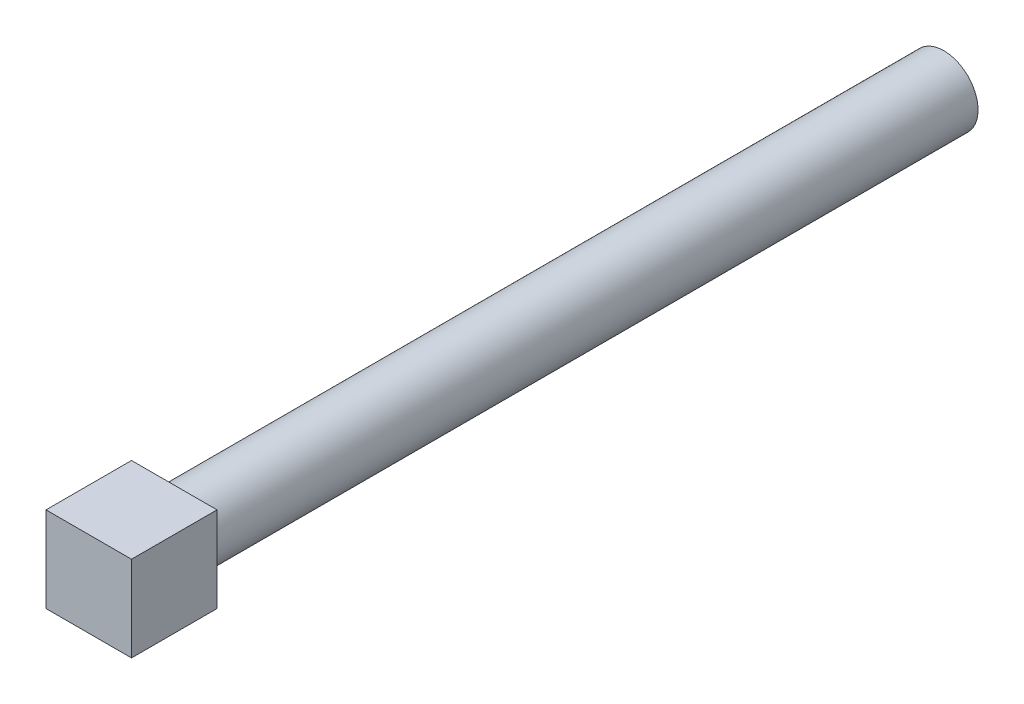
ISO-10303-21;
HEADER;
FILE_DESCRIPTION(('STEP AP214'),'2;1');
FILE_NAME('part.step','',(''),(''),'','','');
FILE_SCHEMA(('AUTOMOTIVE_DESIGN { 1 0 10303 214 1 1 1 1 }'));
ENDSEC;
DATA;
#1=APPLICATION_CONTEXT('core data for automotive mechanical design processes');
#2=APPLICATION_PROTOCOL_DEFINITION('international standard','automotive_design',2000,#1);
#3=PRODUCT_CONTEXT('',#1,'mechanical');
#4=PRODUCT('Part','Part','',(#3));
#5=PRODUCT_RELATED_PRODUCT_CATEGORY('part','',(#4));
#6=PRODUCT_DEFINITION_FORMATION('','',#4);
#7=PRODUCT_DEFINITION_CONTEXT('part definition',#1,'design');
#8=PRODUCT_DEFINITION('design','',#6,#7);
#9=PRODUCT_DEFINITION_SHAPE('','',#8);
#10=(LENGTH_UNIT() NAMED_UNIT(*) SI_UNIT(.MILLI.,.METRE.));
#11=(NAMED_UNIT(*) PLANE_ANGLE_UNIT() SI_UNIT($,.RADIAN.));
#12=(NAMED_UNIT(*) SI_UNIT($,.STERADIAN.) SOLID_ANGLE_UNIT());
#13=UNCERTAINTY_MEASURE_WITH_UNIT(LENGTH_MEASURE(1.E-05),#10,'distance_accuracy_value','');
#14=(GEOMETRIC_REPRESENTATION_CONTEXT(3) GLOBAL_UNCERTAINTY_ASSIGNED_CONTEXT((#13)) GLOBAL_UNIT_ASSIGNED_CONTEXT((#10,
#11,#12)) REPRESENTATION_CONTEXT('',''));
#15=CARTESIAN_POINT('',(0.,0.,0.));
#16=DIRECTION('',(0.,0.,1.));
#17=DIRECTION('',(1.,0.,0.));
#18=AXIS2_PLACEMENT_3D('',#15,#16,#17);
#19=CARTESIAN_POINT('',(-5.,5.,10.));
#20=DIRECTION('',(1.,0.,0.));
#21=DIRECTION('',(0.,1.,0.));
#22=AXIS2_PLACEMENT_3D('',#19,#20,#21);
#23=PLANE('',#22);
#24=DIRECTION('',(0.,-1.,0.));
#25=VECTOR('',#24,1.);
#26=CARTESIAN_POINT('',(-5.,5.,0.));
#27=LINE('',#26,#25);
#28=CARTESIAN_POINT('',(-5.,5.,0.));
#29=VERTEX_POINT('',#28);
#30=CARTESIAN_POINT('',(-5.,-5.,0.));
#31=VERTEX_POINT('',#30);
#32=EDGE_CURVE('E100',#29,#31,#27,.T.);
#33=ORIENTED_EDGE('',*,*,#32,.T.);
#34=DIRECTION('',(0.,0.,-1.));
#35=VECTOR('',#34,1.);
#36=CARTESIAN_POINT('',(-5.,-5.,10.));
#37=LINE('',#36,#35);
#38=CARTESIAN_POINT('',(-5.,-5.,10.));
#39=VERTEX_POINT('',#38);
#40=EDGE_CURVE('E37',#39,#31,#37,.T.);
#41=ORIENTED_EDGE('',*,*,#40,.F.);
#42=DIRECTION('',(0.,-1.,0.));
#43=VECTOR('',#42,1.);
#44=CARTESIAN_POINT('',(-5.,5.,10.));
#45=LINE('',#44,#43);
#46=CARTESIAN_POINT('',(-5.,5.,10.));
#47=VERTEX_POINT('',#46);
#48=EDGE_CURVE('E87',#47,#39,#45,.T.);
#49=ORIENTED_EDGE('',*,*,#48,.F.);
#50=DIRECTION('',(0.,0.,-1.));
#51=VECTOR('',#50,1.);
#52=CARTESIAN_POINT('',(-5.,5.,10.));
#53=LINE('',#52,#51);
#54=EDGE_CURVE('E96',#47,#29,#53,.T.);
#55=ORIENTED_EDGE('',*,*,#54,.T.);
#56=EDGE_LOOP('',(#33,#41,#49,#55));
#57=FACE_BOUND('',#56,.T.);
#58=ADVANCED_FACE('F34',(#57),#23,.F.);
#59=CARTESIAN_POINT('',(-5.,-5.,10.));
#60=DIRECTION('',(0.,1.,0.));
#61=DIRECTION('',(0.,0.,1.));
#62=AXIS2_PLACEMENT_3D('',#59,#60,#61);
#63=PLANE('',#62);
#64=DIRECTION('',(1.,0.,0.));
#65=VECTOR('',#64,1.);
#66=CARTESIAN_POINT('',(-5.,-5.,0.));
#67=LINE('',#66,#65);
#68=CARTESIAN_POINT('',(5.,-5.,0.));
#69=VERTEX_POINT('',#68);
#70=EDGE_CURVE('E92',#31,#69,#67,.T.);
#71=ORIENTED_EDGE('',*,*,#70,.T.);
#72=DIRECTION('',(0.,0.,-1.));
#73=VECTOR('',#72,1.);
#74=CARTESIAN_POINT('',(5.,-5.,10.));
#75=LINE('',#74,#73);
#76=CARTESIAN_POINT('',(5.,-5.,10.));
#77=VERTEX_POINT('',#76);
#78=EDGE_CURVE('E90',#77,#69,#75,.T.);
#79=ORIENTED_EDGE('',*,*,#78,.F.);
#80=DIRECTION('',(1.,0.,0.));
#81=VECTOR('',#80,1.);
#82=CARTESIAN_POINT('',(-5.,-5.,10.));
#83=LINE('',#82,#81);
#84=EDGE_CURVE('E82',#39,#77,#83,.T.);
#85=ORIENTED_EDGE('',*,*,#84,.F.);
#86=ORIENTED_EDGE('',*,*,#40,.T.);
#87=EDGE_LOOP('',(#71,#79,#85,#86));
#88=FACE_BOUND('',#87,.T.);
#89=ADVANCED_FACE('F91',(#88),#63,.F.);
#90=CARTESIAN_POINT('',(5.,5.,10.));
#91=DIRECTION('',(-1.,0.,0.));
#92=DIRECTION('',(0.,-1.,0.));
#93=AXIS2_PLACEMENT_3D('',#90,#91,#92);
#94=PLANE('',#93);
#95=DIRECTION('',(0.,1.,0.));
#96=VECTOR('',#95,1.);
#97=CARTESIAN_POINT('',(5.,5.,0.));
#98=LINE('',#97,#96);
#99=CARTESIAN_POINT('',(5.,5.,0.));
#100=VERTEX_POINT('',#99);
#101=EDGE_CURVE('E68',#69,#100,#98,.T.);
#102=ORIENTED_EDGE('',*,*,#101,.T.);
#103=DIRECTION('',(0.,0.,-1.));
#104=VECTOR('',#103,1.);
#105=CARTESIAN_POINT('',(5.,5.,10.));
#106=LINE('',#105,#104);
#107=CARTESIAN_POINT('',(5.,5.,10.));
#108=VERTEX_POINT('',#107);
#109=EDGE_CURVE('E93',#108,#100,#106,.T.);
#110=ORIENTED_EDGE('',*,*,#109,.F.);
#111=DIRECTION('',(0.,1.,0.));
#112=VECTOR('',#111,1.);
#113=CARTESIAN_POINT('',(5.,5.,10.));
#114=LINE('',#113,#112);
#115=EDGE_CURVE('E85',#77,#108,#114,.T.);
#116=ORIENTED_EDGE('',*,*,#115,.F.);
#117=ORIENTED_EDGE('',*,*,#78,.T.);
#118=EDGE_LOOP('',(#102,#110,#116,#117));
#119=FACE_BOUND('',#118,.T.);
#120=ADVANCED_FACE('F94',(#119),#94,.F.);
#121=CARTESIAN_POINT('',(-5.,5.,10.));
#122=DIRECTION('',(0.,-1.,0.));
#123=DIRECTION('',(0.,0.,-1.));
#124=AXIS2_PLACEMENT_3D('',#121,#122,#123);
#125=PLANE('',#124);
#126=DIRECTION('',(-1.,0.,0.));
#127=VECTOR('',#126,1.);
#128=CARTESIAN_POINT('',(-5.,5.,0.));
#129=LINE('',#128,#127);
#130=EDGE_CURVE('E74',#100,#29,#129,.T.);
#131=ORIENTED_EDGE('',*,*,#130,.T.);
#132=ORIENTED_EDGE('',*,*,#54,.F.);
#133=DIRECTION('',(-1.,0.,0.));
#134=VECTOR('',#133,1.);
#135=CARTESIAN_POINT('',(-5.,5.,10.));
#136=LINE('',#135,#134);
#137=EDGE_CURVE('E51',#108,#47,#136,.T.);
#138=ORIENTED_EDGE('',*,*,#137,.F.);
#139=ORIENTED_EDGE('',*,*,#109,.T.);
#140=EDGE_LOOP('',(#131,#132,#138,#139));
#141=FACE_BOUND('',#140,.T.);
#142=ADVANCED_FACE('F108',(#141),#125,.F.);
#143=CARTESIAN_POINT('',(0.,0.,10.));
#144=DIRECTION('',(0.,0.,1.));
#145=DIRECTION('',(1.,0.,0.));
#146=AXIS2_PLACEMENT_3D('',#143,#144,#145);
#147=PLANE('',#146);
#148=ORIENTED_EDGE('',*,*,#48,.T.);
#149=ORIENTED_EDGE('',*,*,#84,.T.);
#150=ORIENTED_EDGE('',*,*,#115,.T.);
#151=ORIENTED_EDGE('',*,*,#137,.T.);
#152=EDGE_LOOP('',(#148,#149,#150,#151));
#153=FACE_BOUND('',#152,.T.);
#154=ADVANCED_FACE('F83',(#153),#147,.T.);
#155=CARTESIAN_POINT('',(0.,0.,0.));
#156=DIRECTION('',(0.,0.,1.));
#157=DIRECTION('',(1.,0.,0.));
#158=AXIS2_PLACEMENT_3D('',#155,#156,#157);
#159=PLANE('',#158);
#160=CARTESIAN_POINT('',(0.,0.,0.));
#161=DIRECTION('',(0.,0.,-1.));
#162=DIRECTION('',(-1.,0.,0.));
#163=AXIS2_PLACEMENT_3D('',#160,#161,#162);
#164=CIRCLE('',#163,4.);
#165=CARTESIAN_POINT('',(-4.,0.,0.));
#166=VERTEX_POINT('',#165);
#167=EDGE_CURVE('E11',#166,#166,#164,.T.);
#168=ORIENTED_EDGE('',*,*,#167,.F.);
#169=EDGE_LOOP('',(#168));
#170=FACE_BOUND('',#169,.T.);
#171=ORIENTED_EDGE('',*,*,#32,.F.);
#172=ORIENTED_EDGE('',*,*,#130,.F.);
#173=ORIENTED_EDGE('',*,*,#101,.F.);
#174=ORIENTED_EDGE('',*,*,#70,.F.);
#175=EDGE_LOOP('',(#171,#172,#173,#174));
#176=FACE_BOUND('',#175,.T.);
#177=ADVANCED_FACE('F111',(#170,#176),#159,.F.);
#178=CARTESIAN_POINT('',(0.,0.,-90.));
#179=DIRECTION('',(0.,0.,1.));
#180=DIRECTION('',(1.,0.,0.));
#181=AXIS2_PLACEMENT_3D('',#178,#179,#180);
#182=CYLINDRICAL_SURFACE('',#181,4.);
#183=CARTESIAN_POINT('',(0.,0.,-90.));
#184=DIRECTION('',(0.,0.,-1.));
#185=DIRECTION('',(-1.,0.,0.));
#186=AXIS2_PLACEMENT_3D('',#183,#184,#185);
#187=CIRCLE('',#186,4.);
#188=CARTESIAN_POINT('',(-4.,0.,-90.));
#189=VERTEX_POINT('',#188);
#190=EDGE_CURVE('E103',#189,#189,#187,.T.);
#191=ORIENTED_EDGE('',*,*,#190,.F.);
#192=EDGE_LOOP('',(#191));
#193=FACE_BOUND('',#192,.T.);
#194=ORIENTED_EDGE('',*,*,#167,.T.);
#195=EDGE_LOOP('',(#194));
#196=FACE_BOUND('',#195,.T.);
#197=ADVANCED_FACE('F119',(#193,#196),#182,.T.);
#198=CARTESIAN_POINT('',(0.,0.,-90.));
#199=DIRECTION('',(0.,0.,-1.));
#200=DIRECTION('',(-1.,0.,0.));
#201=AXIS2_PLACEMENT_3D('',#198,#199,#200);
#202=PLANE('',#201);
#203=ORIENTED_EDGE('',*,*,#190,.T.);
#204=EDGE_LOOP('',(#203));
#205=FACE_BOUND('',#204,.T.);
#206=ADVANCED_FACE('F117',(#205),#202,.T.);
#207=CLOSED_SHELL('',(#58,#89,#120,#142,#154,#177,#197,#206));
#208=MANIFOLD_SOLID_BREP('B2',#207);
#209=ADVANCED_BREP_SHAPE_REPRESENTATION('',(#18,#208),#14);
#210=SHAPE_DEFINITION_REPRESENTATION(#9,#209);
ENDSEC;
END-ISO-10303-21;
